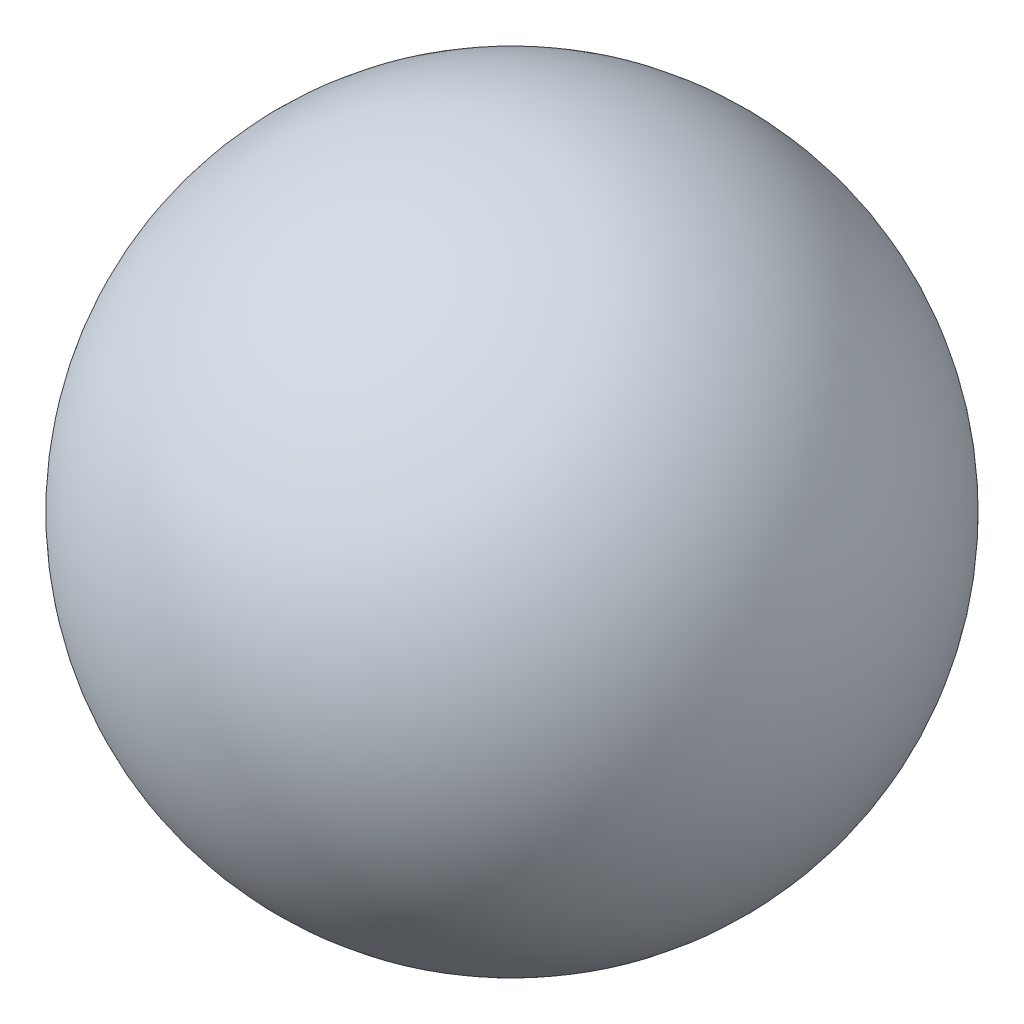
ISO-10303-21;
HEADER;
FILE_DESCRIPTION(('STEP AP214'),'2;1');
FILE_NAME('part.step','',(''),(''),'','','');
FILE_SCHEMA(('AUTOMOTIVE_DESIGN { 1 0 10303 214 1 1 1 1 }'));
ENDSEC;
DATA;
#1=APPLICATION_CONTEXT('core data for automotive mechanical design processes');
#2=APPLICATION_PROTOCOL_DEFINITION('international standard','automotive_design',2000,#1);
#3=PRODUCT_CONTEXT('',#1,'mechanical');
#4=PRODUCT('Part','Part','',(#3));
#5=PRODUCT_RELATED_PRODUCT_CATEGORY('part','',(#4));
#6=PRODUCT_DEFINITION_FORMATION('','',#4);
#7=PRODUCT_DEFINITION_CONTEXT('part definition',#1,'design');
#8=PRODUCT_DEFINITION('design','',#6,#7);
#9=PRODUCT_DEFINITION_SHAPE('','',#8);
#10=(LENGTH_UNIT() NAMED_UNIT(*) SI_UNIT(.MILLI.,.METRE.));
#11=(NAMED_UNIT(*) PLANE_ANGLE_UNIT() SI_UNIT($,.RADIAN.));
#12=(NAMED_UNIT(*) SI_UNIT($,.STERADIAN.) SOLID_ANGLE_UNIT());
#13=UNCERTAINTY_MEASURE_WITH_UNIT(LENGTH_MEASURE(1.E-05),#10,'distance_accuracy_value','');
#14=(GEOMETRIC_REPRESENTATION_CONTEXT(3) GLOBAL_UNCERTAINTY_ASSIGNED_CONTEXT((#13)) GLOBAL_UNIT_ASSIGNED_CONTEXT((#10,
#11,#12)) REPRESENTATION_CONTEXT('',''));
#15=CARTESIAN_POINT('',(0.,0.,0.));
#16=DIRECTION('',(0.,0.,1.));
#17=DIRECTION('',(1.,0.,0.));
#18=AXIS2_PLACEMENT_3D('',#15,#16,#17);
#19=CARTESIAN_POINT('',(0.,0.,0.));
#20=DIRECTION('',(0.,-1.,0.));
#21=DIRECTION('',(-1.,0.,0.));
#22=AXIS2_PLACEMENT_3D('',#19,#20,#21);
#23=SPHERICAL_SURFACE('',#22,20.);
#24=CARTESIAN_POINT('',(0.,-20.,0.));
#25=VERTEX_POINT('',#24);
#26=VERTEX_LOOP('',#25);
#27=FACE_BOUND('',#26,.T.);
#28=ADVANCED_FACE('F29',(#27),#23,.T.);
#29=CLOSED_SHELL('',(#28));
#30=MANIFOLD_SOLID_BREP('B2',#29);
#31=ADVANCED_BREP_SHAPE_REPRESENTATION('',(#18,#30),#14);
#32=SHAPE_DEFINITION_REPRESENTATION(#9,#31);
ENDSEC;
END-ISO-10303-21;
